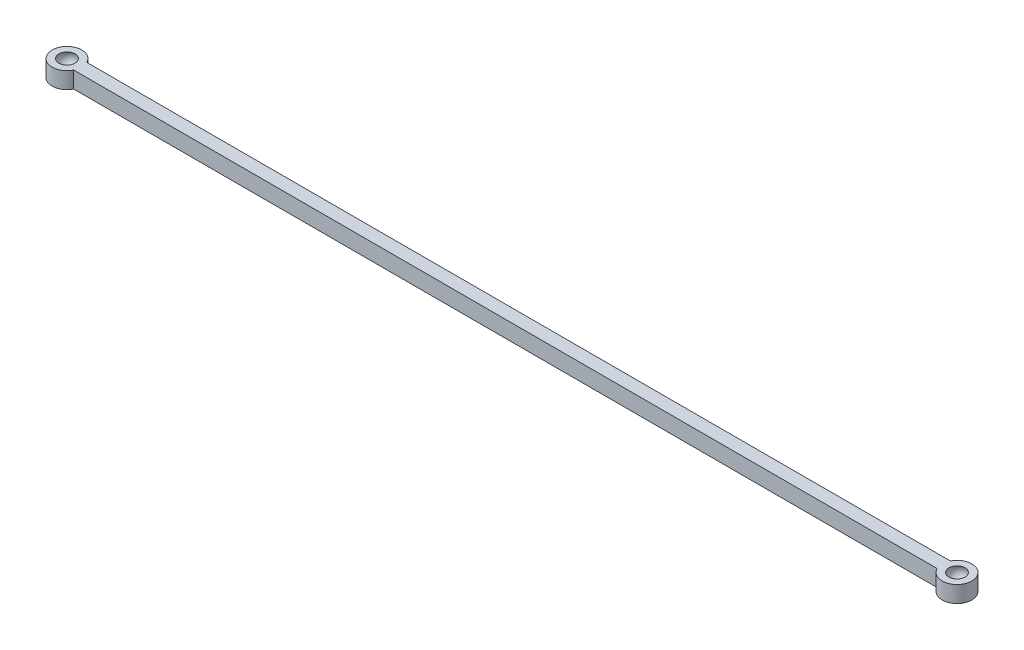
ISO-10303-21;
HEADER;
FILE_DESCRIPTION(('STEP AP214'),'2;1');
FILE_NAME('part.step','',(''),(''),'','','');
FILE_SCHEMA(('AUTOMOTIVE_DESIGN { 1 0 10303 214 1 1 1 1 }'));
ENDSEC;
DATA;
#1=APPLICATION_CONTEXT('core data for automotive mechanical design processes');
#2=APPLICATION_PROTOCOL_DEFINITION('international standard','automotive_design',2000,#1);
#3=PRODUCT_CONTEXT('',#1,'mechanical');
#4=PRODUCT('Part','Part','',(#3));
#5=PRODUCT_RELATED_PRODUCT_CATEGORY('part','',(#4));
#6=PRODUCT_DEFINITION_FORMATION('','',#4);
#7=PRODUCT_DEFINITION_CONTEXT('part definition',#1,'design');
#8=PRODUCT_DEFINITION('design','',#6,#7);
#9=PRODUCT_DEFINITION_SHAPE('','',#8);
#10=(LENGTH_UNIT() NAMED_UNIT(*) SI_UNIT(.MILLI.,.METRE.));
#11=(NAMED_UNIT(*) PLANE_ANGLE_UNIT() SI_UNIT($,.RADIAN.));
#12=(NAMED_UNIT(*) SI_UNIT($,.STERADIAN.) SOLID_ANGLE_UNIT());
#13=UNCERTAINTY_MEASURE_WITH_UNIT(LENGTH_MEASURE(1.E-05),#10,'distance_accuracy_value','');
#14=(GEOMETRIC_REPRESENTATION_CONTEXT(3) GLOBAL_UNCERTAINTY_ASSIGNED_CONTEXT((#13)) GLOBAL_UNIT_ASSIGNED_CONTEXT((#10,
#11,#12)) REPRESENTATION_CONTEXT('',''));
#15=CARTESIAN_POINT('',(0.,0.,0.));
#16=DIRECTION('',(0.,0.,1.));
#17=DIRECTION('',(1.,0.,0.));
#18=AXIS2_PLACEMENT_3D('',#15,#16,#17);
#19=CARTESIAN_POINT('',(-135.,5.,0.));
#20=DIRECTION('',(0.,-1.,0.));
#21=DIRECTION('',(0.,0.,-1.));
#22=AXIS2_PLACEMENT_3D('',#19,#20,#21);
#23=CYLINDRICAL_SURFACE('',#22,4.49999999999999);
#24=CARTESIAN_POINT('',(-135.,0.,0.));
#25=DIRECTION('',(0.,1.,0.));
#26=DIRECTION('',(0.,0.,1.));
#27=AXIS2_PLACEMENT_3D('',#24,#25,#26);
#28=CIRCLE('',#27,4.49999999999999);
#29=CARTESIAN_POINT('',(-130.968871125851,0.,-2.));
#30=VERTEX_POINT('',#29);
#31=CARTESIAN_POINT('',(-130.968871125851,0.,2.));
#32=VERTEX_POINT('',#31);
#33=EDGE_CURVE('E93',#30,#32,#28,.T.);
#34=ORIENTED_EDGE('',*,*,#33,.T.);
#35=DIRECTION('',(0.,-1.,0.));
#36=VECTOR('',#35,1.);
#37=CARTESIAN_POINT('',(-130.968871125851,5.,2.));
#38=LINE('',#37,#36);
#39=CARTESIAN_POINT('',(-130.968871125851,5.,2.));
#40=VERTEX_POINT('',#39);
#41=EDGE_CURVE('E134',#40,#32,#38,.T.);
#42=ORIENTED_EDGE('',*,*,#41,.F.);
#43=CARTESIAN_POINT('',(-135.,5.,0.));
#44=DIRECTION('',(0.,1.,0.));
#45=DIRECTION('',(0.,0.,1.));
#46=AXIS2_PLACEMENT_3D('',#43,#44,#45);
#47=CIRCLE('',#46,4.49999999999999);
#48=CARTESIAN_POINT('',(-130.968871125851,5.,-2.));
#49=VERTEX_POINT('',#48);
#50=EDGE_CURVE('E96',#49,#40,#47,.T.);
#51=ORIENTED_EDGE('',*,*,#50,.F.);
#52=DIRECTION('',(0.,-1.,0.));
#53=VECTOR('',#52,1.);
#54=CARTESIAN_POINT('',(-130.968871125851,5.,-2.));
#55=LINE('',#54,#53);
#56=EDGE_CURVE('E111',#49,#30,#55,.T.);
#57=ORIENTED_EDGE('',*,*,#56,.T.);
#58=EDGE_LOOP('',(#34,#42,#51,#57));
#59=FACE_BOUND('',#58,.T.);
#60=ADVANCED_FACE('F41',(#59),#23,.T.);
#61=CARTESIAN_POINT('',(0.,5.,2.));
#62=DIRECTION('',(0.,0.,-1.));
#63=DIRECTION('',(-1.,0.,0.));
#64=AXIS2_PLACEMENT_3D('',#61,#62,#63);
#65=PLANE('',#64);
#66=DIRECTION('',(1.,0.,0.));
#67=VECTOR('',#66,1.);
#68=CARTESIAN_POINT('',(0.,0.,2.));
#69=LINE('',#68,#67);
#70=CARTESIAN_POINT('',(130.968871125851,0.,2.));
#71=VERTEX_POINT('',#70);
#72=EDGE_CURVE('E115',#32,#71,#69,.T.);
#73=ORIENTED_EDGE('',*,*,#72,.T.);
#74=DIRECTION('',(0.,-1.,0.));
#75=VECTOR('',#74,1.);
#76=CARTESIAN_POINT('',(130.968871125851,5.,2.));
#77=LINE('',#76,#75);
#78=CARTESIAN_POINT('',(130.968871125851,5.,2.));
#79=VERTEX_POINT('',#78);
#80=EDGE_CURVE('E130',#79,#71,#77,.T.);
#81=ORIENTED_EDGE('',*,*,#80,.F.);
#82=DIRECTION('',(1.,0.,0.));
#83=VECTOR('',#82,1.);
#84=CARTESIAN_POINT('',(0.,5.,2.));
#85=LINE('',#84,#83);
#86=EDGE_CURVE('E100',#40,#79,#85,.T.);
#87=ORIENTED_EDGE('',*,*,#86,.F.);
#88=ORIENTED_EDGE('',*,*,#41,.T.);
#89=EDGE_LOOP('',(#73,#81,#87,#88));
#90=FACE_BOUND('',#89,.T.);
#91=ADVANCED_FACE('F155',(#90),#65,.F.);
#92=CARTESIAN_POINT('',(135.,5.,0.));
#93=DIRECTION('',(0.,-1.,0.));
#94=DIRECTION('',(0.,0.,-1.));
#95=AXIS2_PLACEMENT_3D('',#92,#93,#94);
#96=CYLINDRICAL_SURFACE('',#95,4.49999999999999);
#97=CARTESIAN_POINT('',(135.,0.,0.));
#98=DIRECTION('',(0.,1.,0.));
#99=DIRECTION('',(0.,0.,1.));
#100=AXIS2_PLACEMENT_3D('',#97,#98,#99);
#101=CIRCLE('',#100,4.49999999999999);
#102=CARTESIAN_POINT('',(130.968871125851,0.,-2.));
#103=VERTEX_POINT('',#102);
#104=EDGE_CURVE('E118',#71,#103,#101,.T.);
#105=ORIENTED_EDGE('',*,*,#104,.T.);
#106=DIRECTION('',(0.,-1.,0.));
#107=VECTOR('',#106,1.);
#108=CARTESIAN_POINT('',(130.968871125851,5.,-2.));
#109=LINE('',#108,#107);
#110=CARTESIAN_POINT('',(130.968871125851,5.,-2.));
#111=VERTEX_POINT('',#110);
#112=EDGE_CURVE('E127',#111,#103,#109,.T.);
#113=ORIENTED_EDGE('',*,*,#112,.F.);
#114=CARTESIAN_POINT('',(135.,5.,0.));
#115=DIRECTION('',(0.,1.,0.));
#116=DIRECTION('',(0.,0.,1.));
#117=AXIS2_PLACEMENT_3D('',#114,#115,#116);
#118=CIRCLE('',#117,4.49999999999999);
#119=EDGE_CURVE('E104',#79,#111,#118,.T.);
#120=ORIENTED_EDGE('',*,*,#119,.F.);
#121=ORIENTED_EDGE('',*,*,#80,.T.);
#122=EDGE_LOOP('',(#105,#113,#120,#121));
#123=FACE_BOUND('',#122,.T.);
#124=ADVANCED_FACE('F160',(#123),#96,.T.);
#125=CARTESIAN_POINT('',(0.,5.,-2.));
#126=DIRECTION('',(0.,0.,-1.));
#127=DIRECTION('',(-1.,0.,0.));
#128=AXIS2_PLACEMENT_3D('',#125,#126,#127);
#129=PLANE('',#128);
#130=DIRECTION('',(1.,0.,0.));
#131=VECTOR('',#130,1.);
#132=CARTESIAN_POINT('',(0.,0.,-2.));
#133=LINE('',#132,#131);
#134=EDGE_CURVE('E101',#30,#103,#133,.T.);
#135=ORIENTED_EDGE('',*,*,#134,.F.);
#136=ORIENTED_EDGE('',*,*,#56,.F.);
#137=DIRECTION('',(1.,0.,0.));
#138=VECTOR('',#137,1.);
#139=CARTESIAN_POINT('',(0.,5.,-2.));
#140=LINE('',#139,#138);
#141=EDGE_CURVE('E107',#49,#111,#140,.T.);
#142=ORIENTED_EDGE('',*,*,#141,.T.);
#143=ORIENTED_EDGE('',*,*,#112,.T.);
#144=EDGE_LOOP('',(#135,#136,#142,#143));
#145=FACE_BOUND('',#144,.T.);
#146=ADVANCED_FACE('F168',(#145),#129,.T.);
#147=CARTESIAN_POINT('',(0.,5.,0.));
#148=DIRECTION('',(0.,1.,0.));
#149=DIRECTION('',(0.,0.,1.));
#150=AXIS2_PLACEMENT_3D('',#147,#148,#149);
#151=PLANE('',#150);
#152=CARTESIAN_POINT('',(135.,5.,0.));
#153=DIRECTION('',(0.,1.,0.));
#154=DIRECTION('',(0.,0.,1.));
#155=AXIS2_PLACEMENT_3D('',#152,#153,#154);
#156=CIRCLE('',#155,2.44948974278318);
#157=CARTESIAN_POINT('',(135.000000000056,5.,2.44948974278318));
#158=VERTEX_POINT('',#157);
#159=EDGE_CURVE('E11',#158,#158,#156,.F.);
#160=ORIENTED_EDGE('',*,*,#159,.T.);
#161=EDGE_LOOP('',(#160));
#162=FACE_BOUND('',#161,.T.);
#163=CARTESIAN_POINT('',(-135.,5.,0.));
#164=DIRECTION('',(0.,1.,0.));
#165=DIRECTION('',(0.,0.,1.));
#166=AXIS2_PLACEMENT_3D('',#163,#164,#165);
#167=CIRCLE('',#166,2.44948974278318);
#168=CARTESIAN_POINT('',(-135.000000000056,5.,2.44948974278318));
#169=VERTEX_POINT('',#168);
#170=EDGE_CURVE('E49',#169,#169,#167,.F.);
#171=ORIENTED_EDGE('',*,*,#170,.T.);
#172=EDGE_LOOP('',(#171));
#173=FACE_BOUND('',#172,.T.);
#174=ORIENTED_EDGE('',*,*,#50,.T.);
#175=ORIENTED_EDGE('',*,*,#86,.T.);
#176=ORIENTED_EDGE('',*,*,#119,.T.);
#177=ORIENTED_EDGE('',*,*,#141,.F.);
#178=EDGE_LOOP('',(#174,#175,#176,#177));
#179=FACE_BOUND('',#178,.T.);
#180=ADVANCED_FACE('F140',(#162,#173,#179),#151,.T.);
#181=CARTESIAN_POINT('',(0.,0.,0.));
#182=DIRECTION('',(0.,1.,0.));
#183=DIRECTION('',(0.,0.,1.));
#184=AXIS2_PLACEMENT_3D('',#181,#182,#183);
#185=PLANE('',#184);
#186=ORIENTED_EDGE('',*,*,#33,.F.);
#187=ORIENTED_EDGE('',*,*,#134,.T.);
#188=ORIENTED_EDGE('',*,*,#104,.F.);
#189=ORIENTED_EDGE('',*,*,#72,.F.);
#190=EDGE_LOOP('',(#186,#187,#188,#189));
#191=FACE_BOUND('',#190,.T.);
#192=ADVANCED_FACE('F144',(#191),#185,.F.);
#193=CARTESIAN_POINT('',(-135.,3.75,0.));
#194=DIRECTION('',(0.,1.,0.));
#195=DIRECTION('',(2.28445620980921E-11,0.,-1.));
#196=AXIS2_PLACEMENT_3D('',#193,#194,#195);
#197=SPHERICAL_SURFACE('',#196,2.75);
#198=CARTESIAN_POINT('',(-135.,3.75,0.));
#199=DIRECTION('',(-1.,0.,-2.28445620980921E-11));
#200=DIRECTION('',(-2.28445620980921E-11,0.,1.));
#201=AXIS2_PLACEMENT_3D('',#198,#199,#200);
#202=CIRCLE('',#201,2.75);
#203=CARTESIAN_POINT('',(-135.,1.,0.));
#204=VERTEX_POINT('',#203);
#205=EDGE_CURVE('E61',#204,#169,#202,.T.);
#206=ORIENTED_EDGE('',*,*,#205,.F.);
#207=ORIENTED_EDGE('',*,*,#205,.T.);
#208=ORIENTED_EDGE('',*,*,#170,.F.);
#209=EDGE_LOOP('',(#206,#207,#208));
#210=FACE_BOUND('',#209,.T.);
#211=ADVANCED_FACE('F142',(#210),#197,.F.);
#212=CARTESIAN_POINT('',(135.,3.75,0.));
#213=DIRECTION('',(0.,-1.,0.));
#214=DIRECTION('',(2.28445620980921E-11,0.,1.));
#215=AXIS2_PLACEMENT_3D('',#212,#213,#214);
#216=SPHERICAL_SURFACE('',#215,2.75);
#217=CARTESIAN_POINT('',(135.,3.75,0.));
#218=DIRECTION('',(-1.,0.,2.28445620980921E-11));
#219=DIRECTION('',(2.28445620980921E-11,0.,1.));
#220=AXIS2_PLACEMENT_3D('',#217,#218,#219);
#221=CIRCLE('',#220,2.75);
#222=CARTESIAN_POINT('',(135.,1.,0.));
#223=VERTEX_POINT('',#222);
#224=EDGE_CURVE('E55',#158,#223,#221,.F.);
#225=ORIENTED_EDGE('',*,*,#224,.T.);
#226=ORIENTED_EDGE('',*,*,#224,.F.);
#227=ORIENTED_EDGE('',*,*,#159,.F.);
#228=EDGE_LOOP('',(#225,#226,#227));
#229=FACE_BOUND('',#228,.T.);
#230=ADVANCED_FACE('F89',(#229),#216,.F.);
#231=CLOSED_SHELL('',(#60,#91,#124,#146,#180,#192,#211,#230));
#232=MANIFOLD_SOLID_BREP('B2',#231);
#233=ADVANCED_BREP_SHAPE_REPRESENTATION('',(#18,#232),#14);
#234=SHAPE_DEFINITION_REPRESENTATION(#9,#233);
ENDSEC;
END-ISO-10303-21;
